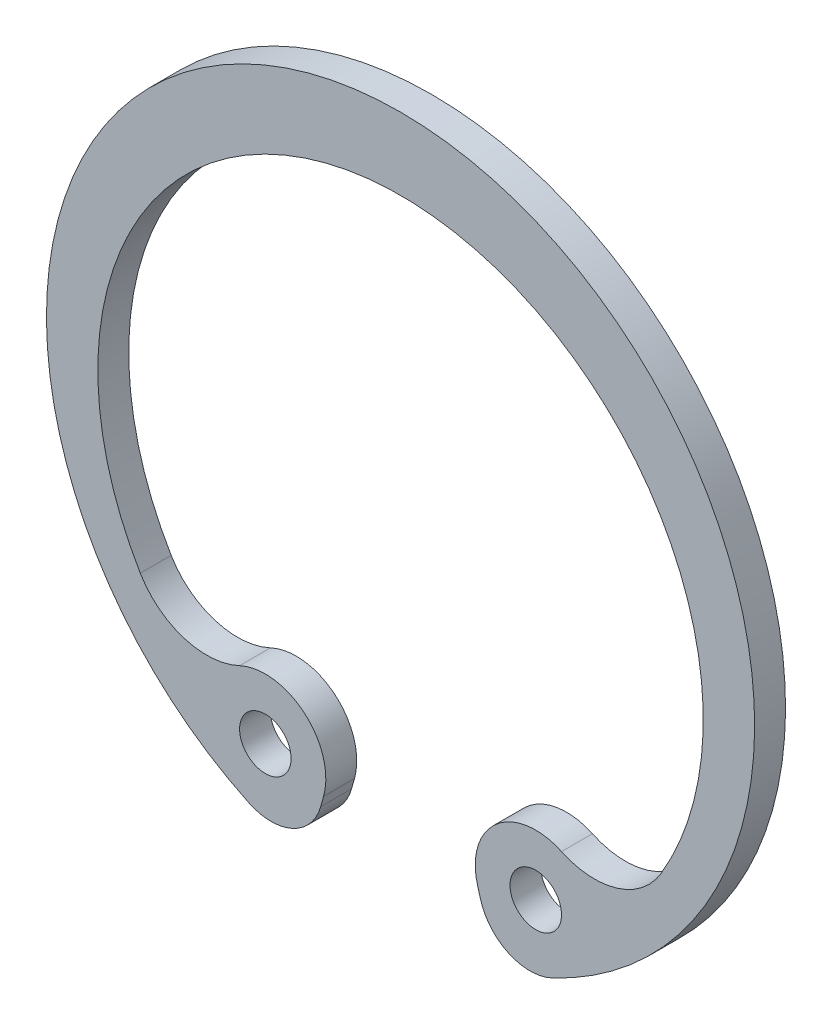
ISO-10303-21;
HEADER;
FILE_DESCRIPTION(('STEP AP214'),'2;1');
FILE_NAME('part.step','',(''),(''),'','','');
FILE_SCHEMA(('AUTOMOTIVE_DESIGN { 1 0 10303 214 1 1 1 1 }'));
ENDSEC;
DATA;
#1=APPLICATION_CONTEXT('core data for automotive mechanical design processes');
#2=APPLICATION_PROTOCOL_DEFINITION('international standard','automotive_design',2000,#1);
#3=PRODUCT_CONTEXT('',#1,'mechanical');
#4=PRODUCT('Part','Part','',(#3));
#5=PRODUCT_RELATED_PRODUCT_CATEGORY('part','',(#4));
#6=PRODUCT_DEFINITION_FORMATION('','',#4);
#7=PRODUCT_DEFINITION_CONTEXT('part definition',#1,'design');
#8=PRODUCT_DEFINITION('design','',#6,#7);
#9=PRODUCT_DEFINITION_SHAPE('','',#8);
#10=(LENGTH_UNIT() NAMED_UNIT(*) SI_UNIT(.MILLI.,.METRE.));
#11=(NAMED_UNIT(*) PLANE_ANGLE_UNIT() SI_UNIT($,.RADIAN.));
#12=(NAMED_UNIT(*) SI_UNIT($,.STERADIAN.) SOLID_ANGLE_UNIT());
#13=UNCERTAINTY_MEASURE_WITH_UNIT(LENGTH_MEASURE(1.E-05),#10,'distance_accuracy_value','');
#14=(GEOMETRIC_REPRESENTATION_CONTEXT(3) GLOBAL_UNCERTAINTY_ASSIGNED_CONTEXT((#13)) GLOBAL_UNIT_ASSIGNED_CONTEXT((#10,
#11,#12)) REPRESENTATION_CONTEXT('',''));
#15=CARTESIAN_POINT('',(0.,0.,0.));
#16=DIRECTION('',(0.,0.,1.));
#17=DIRECTION('',(1.,0.,0.));
#18=AXIS2_PLACEMENT_3D('',#15,#16,#17);
#19=CARTESIAN_POINT('',(-7.52713577864405,-5.27738914112764,1.2));
#20=DIRECTION('',(0.,0.,1.));
#21=DIRECTION('',(1.,0.,0.));
#22=AXIS2_PLACEMENT_3D('',#19,#20,#21);
#23=PLANE('',#22);
#24=CARTESIAN_POINT('',(-5.2507739561119,-10.1189464167279,1.2));
#25=DIRECTION('',(0.,0.,1.));
#26=DIRECTION('',(1.,0.,0.));
#27=AXIS2_PLACEMENT_3D('',#24,#25,#26);
#28=CIRCLE('',#27,1.);
#29=CARTESIAN_POINT('',(-4.25077395611189,-10.1189464167279,1.2));
#30=VERTEX_POINT('',#29);
#31=EDGE_CURVE('E148',#30,#30,#28,.T.);
#32=ORIENTED_EDGE('',*,*,#31,.F.);
#33=EDGE_LOOP('',(#32));
#34=FACE_BOUND('',#33,.T.);
#35=CARTESIAN_POINT('',(-7.52713577864405,-5.27738914112764,1.2));
#36=DIRECTION('',(0.,0.,-1.));
#37=DIRECTION('',(1.,0.,0.));
#38=AXIS2_PLACEMENT_3D('',#35,#36,#37);
#39=CIRCLE('',#38,3.00000000000003);
#40=CARTESIAN_POINT('',(-6.25067120526153,-7.9922810713708,1.2));
#41=VERTEX_POINT('',#40);
#42=CARTESIAN_POINT('',(-10.1062826861273,-6.80970804710632,1.2));
#43=VERTEX_POINT('',#42);
#44=EDGE_CURVE('E163',#41,#43,#39,.T.);
#45=ORIENTED_EDGE('',*,*,#44,.T.);
#46=CARTESIAN_POINT('',(0.,-0.805378482091715,1.2));
#47=DIRECTION('',(0.,0.,-1.));
#48=DIRECTION('',(1.,0.,0.));
#49=AXIS2_PLACEMENT_3D('',#46,#47,#48);
#50=CIRCLE('',#49,11.7553784820917);
#51=CARTESIAN_POINT('',(10.1062826861273,-6.80970804710633,1.2));
#52=VERTEX_POINT('',#51);
#53=EDGE_CURVE('E101',#43,#52,#50,.T.);
#54=ORIENTED_EDGE('',*,*,#53,.T.);
#55=CARTESIAN_POINT('',(7.52713577864405,-5.27738914112764,1.2));
#56=DIRECTION('',(0.,0.,-1.));
#57=DIRECTION('',(-1.,0.,0.));
#58=AXIS2_PLACEMENT_3D('',#55,#56,#57);
#59=CIRCLE('',#58,3.00000000000003);
#60=CARTESIAN_POINT('',(6.25067120526152,-7.99228107137082,1.2));
#61=VERTEX_POINT('',#60);
#62=EDGE_CURVE('E184',#52,#61,#59,.T.);
#63=ORIENTED_EDGE('',*,*,#62,.T.);
#64=CARTESIAN_POINT('',(5.2507739561119,-10.1189464167279,1.2));
#65=DIRECTION('',(0.,0.,1.));
#66=DIRECTION('',(-1.,0.,0.));
#67=AXIS2_PLACEMENT_3D('',#64,#65,#66);
#68=CIRCLE('',#67,2.35);
#69=CARTESIAN_POINT('',(2.98892475852639,-10.7565499043139,1.2));
#70=VERTEX_POINT('',#69);
#71=EDGE_CURVE('E203',#61,#70,#68,.T.);
#72=ORIENTED_EDGE('',*,*,#71,.T.);
#73=DIRECTION('',(0.271320633015299,-0.962489020249154,0.));
#74=VECTOR('',#73,1.);
#75=CARTESIAN_POINT('',(3.1033238762739,-11.1623719515887,1.2));
#76=LINE('',#75,#74);
#77=CARTESIAN_POINT('',(3.1033238762739,-11.1623719515887,1.2));
#78=VERTEX_POINT('',#77);
#79=EDGE_CURVE('E200',#70,#78,#76,.T.);
#80=ORIENTED_EDGE('',*,*,#79,.T.);
#81=CARTESIAN_POINT('',(5.02830191677221,-10.6197306855581,1.2));
#82=DIRECTION('',(0.,0.,1.));
#83=DIRECTION('',(-1.,0.,0.));
#84=AXIS2_PLACEMENT_3D('',#81,#82,#83);
#85=CIRCLE('',#84,2.);
#86=CARTESIAN_POINT('',(5.88418309409514,-12.4273444192701,1.2));
#87=VERTEX_POINT('',#86);
#88=EDGE_CURVE('E202',#78,#87,#85,.T.);
#89=ORIENTED_EDGE('',*,*,#88,.T.);
#90=CARTESIAN_POINT('',(0.,0.,1.2));
#91=DIRECTION('',(0.,0.,1.));
#92=DIRECTION('',(1.,0.,0.));
#93=AXIS2_PLACEMENT_3D('',#90,#91,#92);
#94=CIRCLE('',#93,13.75);
#95=CARTESIAN_POINT('',(-5.88418309409514,-12.4273444192701,1.2));
#96=VERTEX_POINT('',#95);
#97=EDGE_CURVE('E126',#87,#96,#94,.T.);
#98=ORIENTED_EDGE('',*,*,#97,.T.);
#99=CARTESIAN_POINT('',(-5.02830191677221,-10.6197306855581,1.2));
#100=DIRECTION('',(0.,0.,1.));
#101=DIRECTION('',(1.,0.,0.));
#102=AXIS2_PLACEMENT_3D('',#99,#100,#101);
#103=CIRCLE('',#102,2.);
#104=CARTESIAN_POINT('',(-3.1033238762739,-11.1623719515887,1.2));
#105=VERTEX_POINT('',#104);
#106=EDGE_CURVE('E120',#96,#105,#103,.T.);
#107=ORIENTED_EDGE('',*,*,#106,.T.);
#108=DIRECTION('',(0.271320633015299,0.962489020249154,0.));
#109=VECTOR('',#108,1.);
#110=CARTESIAN_POINT('',(-3.1033238762739,-11.1623719515887,1.2));
#111=LINE('',#110,#109);
#112=CARTESIAN_POINT('',(-2.98892475852639,-10.7565499043139,1.2));
#113=VERTEX_POINT('',#112);
#114=EDGE_CURVE('E124',#105,#113,#111,.T.);
#115=ORIENTED_EDGE('',*,*,#114,.T.);
#116=CARTESIAN_POINT('',(-5.2507739561119,-10.1189464167279,1.2));
#117=DIRECTION('',(0.,0.,1.));
#118=DIRECTION('',(1.,0.,0.));
#119=AXIS2_PLACEMENT_3D('',#116,#117,#118);
#120=CIRCLE('',#119,2.35);
#121=EDGE_CURVE('E52',#113,#41,#120,.T.);
#122=ORIENTED_EDGE('',*,*,#121,.T.);
#123=EDGE_LOOP('',(#45,#54,#63,#72,#80,#89,#98,#107,#115,#122));
#124=FACE_BOUND('',#123,.T.);
#125=CARTESIAN_POINT('',(5.2507739561119,-10.1189464167279,1.2));
#126=DIRECTION('',(0.,0.,1.));
#127=DIRECTION('',(-1.,0.,0.));
#128=AXIS2_PLACEMENT_3D('',#125,#126,#127);
#129=CIRCLE('',#128,1.);
#130=CARTESIAN_POINT('',(4.25077395611189,-10.1189464167279,1.2));
#131=VERTEX_POINT('',#130);
#132=EDGE_CURVE('E214',#131,#131,#129,.T.);
#133=ORIENTED_EDGE('',*,*,#132,.F.);
#134=EDGE_LOOP('',(#133));
#135=FACE_BOUND('',#134,.T.);
#136=ADVANCED_FACE('F35',(#34,#124,#135),#23,.T.);
#137=CARTESIAN_POINT('',(-7.52713577864405,-5.27738914112764,0.));
#138=DIRECTION('',(0.,0.,1.));
#139=DIRECTION('',(1.,0.,0.));
#140=AXIS2_PLACEMENT_3D('',#137,#138,#139);
#141=PLANE('',#140);
#142=CARTESIAN_POINT('',(-7.52713577864405,-5.27738914112764,0.));
#143=DIRECTION('',(0.,0.,-1.));
#144=DIRECTION('',(1.,0.,0.));
#145=AXIS2_PLACEMENT_3D('',#142,#143,#144);
#146=CIRCLE('',#145,3.00000000000003);
#147=CARTESIAN_POINT('',(-6.25067120526153,-7.9922810713708,0.));
#148=VERTEX_POINT('',#147);
#149=CARTESIAN_POINT('',(-10.1062826861273,-6.80970804710632,0.));
#150=VERTEX_POINT('',#149);
#151=EDGE_CURVE('E144',#148,#150,#146,.T.);
#152=ORIENTED_EDGE('',*,*,#151,.F.);
#153=CARTESIAN_POINT('',(-5.2507739561119,-10.1189464167279,0.));
#154=DIRECTION('',(0.,0.,1.));
#155=DIRECTION('',(1.,0.,0.));
#156=AXIS2_PLACEMENT_3D('',#153,#154,#155);
#157=CIRCLE('',#156,2.35);
#158=CARTESIAN_POINT('',(-2.98892475852639,-10.7565499043139,0.));
#159=VERTEX_POINT('',#158);
#160=EDGE_CURVE('E93',#159,#148,#157,.T.);
#161=ORIENTED_EDGE('',*,*,#160,.F.);
#162=DIRECTION('',(0.271320633015299,0.962489020249154,0.));
#163=VECTOR('',#162,1.);
#164=CARTESIAN_POINT('',(-3.1033238762739,-11.1623719515887,0.));
#165=LINE('',#164,#163);
#166=CARTESIAN_POINT('',(-3.1033238762739,-11.1623719515887,0.));
#167=VERTEX_POINT('',#166);
#168=EDGE_CURVE('E87',#167,#159,#165,.T.);
#169=ORIENTED_EDGE('',*,*,#168,.F.);
#170=CARTESIAN_POINT('',(-5.02830191677221,-10.6197306855581,0.));
#171=DIRECTION('',(0.,0.,1.));
#172=DIRECTION('',(1.,0.,0.));
#173=AXIS2_PLACEMENT_3D('',#170,#171,#172);
#174=CIRCLE('',#173,2.);
#175=CARTESIAN_POINT('',(-5.88418309409514,-12.4273444192701,0.));
#176=VERTEX_POINT('',#175);
#177=EDGE_CURVE('E134',#176,#167,#174,.T.);
#178=ORIENTED_EDGE('',*,*,#177,.F.);
#179=CARTESIAN_POINT('',(0.,0.,0.));
#180=DIRECTION('',(0.,0.,1.));
#181=DIRECTION('',(1.,0.,0.));
#182=AXIS2_PLACEMENT_3D('',#179,#180,#181);
#183=CIRCLE('',#182,13.75);
#184=CARTESIAN_POINT('',(5.88418309409514,-12.4273444192701,0.));
#185=VERTEX_POINT('',#184);
#186=EDGE_CURVE('E158',#185,#176,#183,.T.);
#187=ORIENTED_EDGE('',*,*,#186,.F.);
#188=CARTESIAN_POINT('',(5.02830191677221,-10.6197306855581,0.));
#189=DIRECTION('',(0.,0.,1.));
#190=DIRECTION('',(-1.,0.,0.));
#191=AXIS2_PLACEMENT_3D('',#188,#189,#190);
#192=CIRCLE('',#191,2.);
#193=CARTESIAN_POINT('',(3.1033238762739,-11.1623719515887,0.));
#194=VERTEX_POINT('',#193);
#195=EDGE_CURVE('E156',#194,#185,#192,.T.);
#196=ORIENTED_EDGE('',*,*,#195,.F.);
#197=DIRECTION('',(0.271320633015299,-0.962489020249154,0.));
#198=VECTOR('',#197,1.);
#199=CARTESIAN_POINT('',(3.1033238762739,-11.1623719515887,0.));
#200=LINE('',#199,#198);
#201=CARTESIAN_POINT('',(2.98892475852639,-10.7565499043139,0.));
#202=VERTEX_POINT('',#201);
#203=EDGE_CURVE('E154',#202,#194,#200,.T.);
#204=ORIENTED_EDGE('',*,*,#203,.F.);
#205=CARTESIAN_POINT('',(5.2507739561119,-10.1189464167279,0.));
#206=DIRECTION('',(0.,0.,1.));
#207=DIRECTION('',(-1.,0.,0.));
#208=AXIS2_PLACEMENT_3D('',#205,#206,#207);
#209=CIRCLE('',#208,2.35);
#210=CARTESIAN_POINT('',(6.25067120526152,-7.99228107137082,0.));
#211=VERTEX_POINT('',#210);
#212=EDGE_CURVE('E152',#211,#202,#209,.T.);
#213=ORIENTED_EDGE('',*,*,#212,.F.);
#214=CARTESIAN_POINT('',(7.52713577864405,-5.27738914112764,0.));
#215=DIRECTION('',(0.,0.,-1.));
#216=DIRECTION('',(-1.,0.,0.));
#217=AXIS2_PLACEMENT_3D('',#214,#215,#216);
#218=CIRCLE('',#217,3.00000000000003);
#219=CARTESIAN_POINT('',(10.1062826861273,-6.80970804710633,0.));
#220=VERTEX_POINT('',#219);
#221=EDGE_CURVE('E150',#220,#211,#218,.T.);
#222=ORIENTED_EDGE('',*,*,#221,.F.);
#223=CARTESIAN_POINT('',(0.,-0.805378482091715,0.));
#224=DIRECTION('',(0.,0.,-1.));
#225=DIRECTION('',(1.,0.,0.));
#226=AXIS2_PLACEMENT_3D('',#223,#224,#225);
#227=CIRCLE('',#226,11.7553784820917);
#228=EDGE_CURVE('E147',#150,#220,#227,.T.);
#229=ORIENTED_EDGE('',*,*,#228,.F.);
#230=EDGE_LOOP('',(#152,#161,#169,#178,#187,#196,#204,#213,#222,#229));
#231=FACE_BOUND('',#230,.T.);
#232=CARTESIAN_POINT('',(-5.2507739561119,-10.1189464167279,0.));
#233=DIRECTION('',(0.,0.,1.));
#234=DIRECTION('',(1.,0.,0.));
#235=AXIS2_PLACEMENT_3D('',#232,#233,#234);
#236=CIRCLE('',#235,1.);
#237=CARTESIAN_POINT('',(-4.25077395611189,-10.1189464167279,0.));
#238=VERTEX_POINT('',#237);
#239=EDGE_CURVE('E211',#238,#238,#236,.T.);
#240=ORIENTED_EDGE('',*,*,#239,.T.);
#241=EDGE_LOOP('',(#240));
#242=FACE_BOUND('',#241,.T.);
#243=CARTESIAN_POINT('',(5.2507739561119,-10.1189464167279,0.));
#244=DIRECTION('',(0.,0.,1.));
#245=DIRECTION('',(-1.,0.,0.));
#246=AXIS2_PLACEMENT_3D('',#243,#244,#245);
#247=CIRCLE('',#246,1.);
#248=CARTESIAN_POINT('',(4.25077395611189,-10.1189464167279,0.));
#249=VERTEX_POINT('',#248);
#250=EDGE_CURVE('E217',#249,#249,#247,.T.);
#251=ORIENTED_EDGE('',*,*,#250,.T.);
#252=EDGE_LOOP('',(#251));
#253=FACE_BOUND('',#252,.T.);
#254=ADVANCED_FACE('F188',(#231,#242,#253),#141,.F.);
#255=CARTESIAN_POINT('',(-7.52713577864405,-5.27738914112764,1.2));
#256=DIRECTION('',(0.,0.,-1.));
#257=DIRECTION('',(-1.,0.,0.));
#258=AXIS2_PLACEMENT_3D('',#255,#256,#257);
#259=CYLINDRICAL_SURFACE('',#258,3.00000000000003);
#260=ORIENTED_EDGE('',*,*,#151,.T.);
#261=DIRECTION('',(0.,0.,-1.));
#262=VECTOR('',#261,1.);
#263=CARTESIAN_POINT('',(-10.1062826861273,-6.80970804710632,1.2));
#264=LINE('',#263,#262);
#265=EDGE_CURVE('E11',#43,#150,#264,.T.);
#266=ORIENTED_EDGE('',*,*,#265,.F.);
#267=ORIENTED_EDGE('',*,*,#44,.F.);
#268=DIRECTION('',(0.,0.,-1.));
#269=VECTOR('',#268,1.);
#270=CARTESIAN_POINT('',(-6.25067120526153,-7.9922810713708,1.2));
#271=LINE('',#270,#269);
#272=EDGE_CURVE('E140',#41,#148,#271,.T.);
#273=ORIENTED_EDGE('',*,*,#272,.T.);
#274=EDGE_LOOP('',(#260,#266,#267,#273));
#275=FACE_BOUND('',#274,.T.);
#276=ADVANCED_FACE('F37',(#275),#259,.F.);
#277=CARTESIAN_POINT('',(0.,-0.805378482091715,1.2));
#278=DIRECTION('',(0.,0.,-1.));
#279=DIRECTION('',(-1.,0.,0.));
#280=AXIS2_PLACEMENT_3D('',#277,#278,#279);
#281=CYLINDRICAL_SURFACE('',#280,11.7553784820917);
#282=ORIENTED_EDGE('',*,*,#228,.T.);
#283=DIRECTION('',(0.,0.,-1.));
#284=VECTOR('',#283,1.);
#285=CARTESIAN_POINT('',(10.1062826861273,-6.80970804710633,1.2));
#286=LINE('',#285,#284);
#287=EDGE_CURVE('E44',#52,#220,#286,.T.);
#288=ORIENTED_EDGE('',*,*,#287,.F.);
#289=ORIENTED_EDGE('',*,*,#53,.F.);
#290=ORIENTED_EDGE('',*,*,#265,.T.);
#291=EDGE_LOOP('',(#282,#288,#289,#290));
#292=FACE_BOUND('',#291,.T.);
#293=ADVANCED_FACE('F257',(#292),#281,.F.);
#294=CARTESIAN_POINT('',(7.52713577864405,-5.27738914112764,1.2));
#295=DIRECTION('',(0.,0.,-1.));
#296=DIRECTION('',(-1.,0.,0.));
#297=AXIS2_PLACEMENT_3D('',#294,#295,#296);
#298=CYLINDRICAL_SURFACE('',#297,3.00000000000003);
#299=ORIENTED_EDGE('',*,*,#221,.T.);
#300=DIRECTION('',(0.,0.,-1.));
#301=VECTOR('',#300,1.);
#302=CARTESIAN_POINT('',(6.25067120526152,-7.99228107137082,1.2));
#303=LINE('',#302,#301);
#304=EDGE_CURVE('E176',#61,#211,#303,.T.);
#305=ORIENTED_EDGE('',*,*,#304,.F.);
#306=ORIENTED_EDGE('',*,*,#62,.F.);
#307=ORIENTED_EDGE('',*,*,#287,.T.);
#308=EDGE_LOOP('',(#299,#305,#306,#307));
#309=FACE_BOUND('',#308,.T.);
#310=ADVANCED_FACE('F182',(#309),#298,.F.);
#311=CARTESIAN_POINT('',(5.2507739561119,-10.1189464167279,1.2));
#312=DIRECTION('',(0.,0.,-1.));
#313=DIRECTION('',(-1.,0.,0.));
#314=AXIS2_PLACEMENT_3D('',#311,#312,#313);
#315=CYLINDRICAL_SURFACE('',#314,2.35);
#316=ORIENTED_EDGE('',*,*,#212,.T.);
#317=DIRECTION('',(0.,0.,-1.));
#318=VECTOR('',#317,1.);
#319=CARTESIAN_POINT('',(2.98892475852639,-10.7565499043139,1.2));
#320=LINE('',#319,#318);
#321=EDGE_CURVE('E173',#70,#202,#320,.T.);
#322=ORIENTED_EDGE('',*,*,#321,.F.);
#323=ORIENTED_EDGE('',*,*,#71,.F.);
#324=ORIENTED_EDGE('',*,*,#304,.T.);
#325=EDGE_LOOP('',(#316,#322,#323,#324));
#326=FACE_BOUND('',#325,.T.);
#327=ADVANCED_FACE('F194',(#326),#315,.T.);
#328=CARTESIAN_POINT('',(3.1033238762739,-11.1623719515887,1.2));
#329=DIRECTION('',(0.962489020249155,0.271320633015299,0.));
#330=DIRECTION('',(-0.271320633015299,0.962489020249155,0.));
#331=AXIS2_PLACEMENT_3D('',#328,#329,#330);
#332=PLANE('',#331);
#333=ORIENTED_EDGE('',*,*,#203,.T.);
#334=DIRECTION('',(0.,0.,-1.));
#335=VECTOR('',#334,1.);
#336=CARTESIAN_POINT('',(3.1033238762739,-11.1623719515887,1.2));
#337=LINE('',#336,#335);
#338=EDGE_CURVE('E170',#78,#194,#337,.T.);
#339=ORIENTED_EDGE('',*,*,#338,.F.);
#340=ORIENTED_EDGE('',*,*,#79,.F.);
#341=ORIENTED_EDGE('',*,*,#321,.T.);
#342=EDGE_LOOP('',(#333,#339,#340,#341));
#343=FACE_BOUND('',#342,.T.);
#344=ADVANCED_FACE('F198',(#343),#332,.F.);
#345=CARTESIAN_POINT('',(5.02830191677221,-10.6197306855581,1.2));
#346=DIRECTION('',(0.,0.,-1.));
#347=DIRECTION('',(-1.,0.,0.));
#348=AXIS2_PLACEMENT_3D('',#345,#346,#347);
#349=CYLINDRICAL_SURFACE('',#348,2.);
#350=ORIENTED_EDGE('',*,*,#195,.T.);
#351=DIRECTION('',(0.,0.,-1.));
#352=VECTOR('',#351,1.);
#353=CARTESIAN_POINT('',(5.88418309409514,-12.4273444192701,1.2));
#354=LINE('',#353,#352);
#355=EDGE_CURVE('E167',#87,#185,#354,.T.);
#356=ORIENTED_EDGE('',*,*,#355,.F.);
#357=ORIENTED_EDGE('',*,*,#88,.F.);
#358=ORIENTED_EDGE('',*,*,#338,.T.);
#359=EDGE_LOOP('',(#350,#356,#357,#358));
#360=FACE_BOUND('',#359,.T.);
#361=ADVANCED_FACE('F247',(#360),#349,.T.);
#362=CARTESIAN_POINT('',(0.,0.,1.2));
#363=DIRECTION('',(0.,0.,-1.));
#364=DIRECTION('',(-1.,0.,0.));
#365=AXIS2_PLACEMENT_3D('',#362,#363,#364);
#366=CYLINDRICAL_SURFACE('',#365,13.75);
#367=ORIENTED_EDGE('',*,*,#186,.T.);
#368=DIRECTION('',(0.,0.,-1.));
#369=VECTOR('',#368,1.);
#370=CARTESIAN_POINT('',(-5.88418309409514,-12.4273444192701,1.2));
#371=LINE('',#370,#369);
#372=EDGE_CURVE('E135',#96,#176,#371,.T.);
#373=ORIENTED_EDGE('',*,*,#372,.F.);
#374=ORIENTED_EDGE('',*,*,#97,.F.);
#375=ORIENTED_EDGE('',*,*,#355,.T.);
#376=EDGE_LOOP('',(#367,#373,#374,#375));
#377=FACE_BOUND('',#376,.T.);
#378=ADVANCED_FACE('F244',(#377),#366,.T.);
#379=CARTESIAN_POINT('',(-5.02830191677221,-10.6197306855581,1.2));
#380=DIRECTION('',(0.,0.,-1.));
#381=DIRECTION('',(-1.,0.,0.));
#382=AXIS2_PLACEMENT_3D('',#379,#380,#381);
#383=CYLINDRICAL_SURFACE('',#382,2.);
#384=ORIENTED_EDGE('',*,*,#177,.T.);
#385=DIRECTION('',(0.,0.,-1.));
#386=VECTOR('',#385,1.);
#387=CARTESIAN_POINT('',(-3.1033238762739,-11.1623719515887,1.2));
#388=LINE('',#387,#386);
#389=EDGE_CURVE('E131',#105,#167,#388,.T.);
#390=ORIENTED_EDGE('',*,*,#389,.F.);
#391=ORIENTED_EDGE('',*,*,#106,.F.);
#392=ORIENTED_EDGE('',*,*,#372,.T.);
#393=EDGE_LOOP('',(#384,#390,#391,#392));
#394=FACE_BOUND('',#393,.T.);
#395=ADVANCED_FACE('F132',(#394),#383,.T.);
#396=CARTESIAN_POINT('',(-3.1033238762739,-11.1623719515887,1.2));
#397=DIRECTION('',(-0.962489020249155,0.271320633015299,0.));
#398=DIRECTION('',(-0.271320633015299,-0.962489020249155,0.));
#399=AXIS2_PLACEMENT_3D('',#396,#397,#398);
#400=PLANE('',#399);
#401=ORIENTED_EDGE('',*,*,#168,.T.);
#402=DIRECTION('',(0.,0.,-1.));
#403=VECTOR('',#402,1.);
#404=CARTESIAN_POINT('',(-2.98892475852639,-10.7565499043139,1.2));
#405=LINE('',#404,#403);
#406=EDGE_CURVE('E136',#113,#159,#405,.T.);
#407=ORIENTED_EDGE('',*,*,#406,.F.);
#408=ORIENTED_EDGE('',*,*,#114,.F.);
#409=ORIENTED_EDGE('',*,*,#389,.T.);
#410=EDGE_LOOP('',(#401,#407,#408,#409));
#411=FACE_BOUND('',#410,.T.);
#412=ADVANCED_FACE('F138',(#411),#400,.F.);
#413=CARTESIAN_POINT('',(-5.2507739561119,-10.1189464167279,1.2));
#414=DIRECTION('',(0.,0.,-1.));
#415=DIRECTION('',(-1.,0.,0.));
#416=AXIS2_PLACEMENT_3D('',#413,#414,#415);
#417=CYLINDRICAL_SURFACE('',#416,2.35);
#418=ORIENTED_EDGE('',*,*,#160,.T.);
#419=ORIENTED_EDGE('',*,*,#272,.F.);
#420=ORIENTED_EDGE('',*,*,#121,.F.);
#421=ORIENTED_EDGE('',*,*,#406,.T.);
#422=EDGE_LOOP('',(#418,#419,#420,#421));
#423=FACE_BOUND('',#422,.T.);
#424=ADVANCED_FACE('F237',(#423),#417,.T.);
#425=CARTESIAN_POINT('',(-5.2507739561119,-10.1189464167279,1.2));
#426=DIRECTION('',(0.,0.,-1.));
#427=DIRECTION('',(-1.,0.,0.));
#428=AXIS2_PLACEMENT_3D('',#425,#426,#427);
#429=CYLINDRICAL_SURFACE('',#428,1.);
#430=ORIENTED_EDGE('',*,*,#31,.T.);
#431=EDGE_LOOP('',(#430));
#432=FACE_BOUND('',#431,.T.);
#433=ORIENTED_EDGE('',*,*,#239,.F.);
#434=EDGE_LOOP('',(#433));
#435=FACE_BOUND('',#434,.T.);
#436=ADVANCED_FACE('F234',(#432,#435),#429,.F.);
#437=CARTESIAN_POINT('',(5.2507739561119,-10.1189464167279,1.2));
#438=DIRECTION('',(0.,0.,-1.));
#439=DIRECTION('',(-1.,0.,0.));
#440=AXIS2_PLACEMENT_3D('',#437,#438,#439);
#441=CYLINDRICAL_SURFACE('',#440,1.);
#442=ORIENTED_EDGE('',*,*,#132,.T.);
#443=EDGE_LOOP('',(#442));
#444=FACE_BOUND('',#443,.T.);
#445=ORIENTED_EDGE('',*,*,#250,.F.);
#446=EDGE_LOOP('',(#445));
#447=FACE_BOUND('',#446,.T.);
#448=ADVANCED_FACE('F223',(#444,#447),#441,.F.);
#449=CLOSED_SHELL('',(#136,#254,#276,#293,#310,#327,#344,#361,#378,#395,#412,#424,#436,#448));
#450=MANIFOLD_SOLID_BREP('B2',#449);
#451=ADVANCED_BREP_SHAPE_REPRESENTATION('',(#18,#450),#14);
#452=SHAPE_DEFINITION_REPRESENTATION(#9,#451);
ENDSEC;
END-ISO-10303-21;
